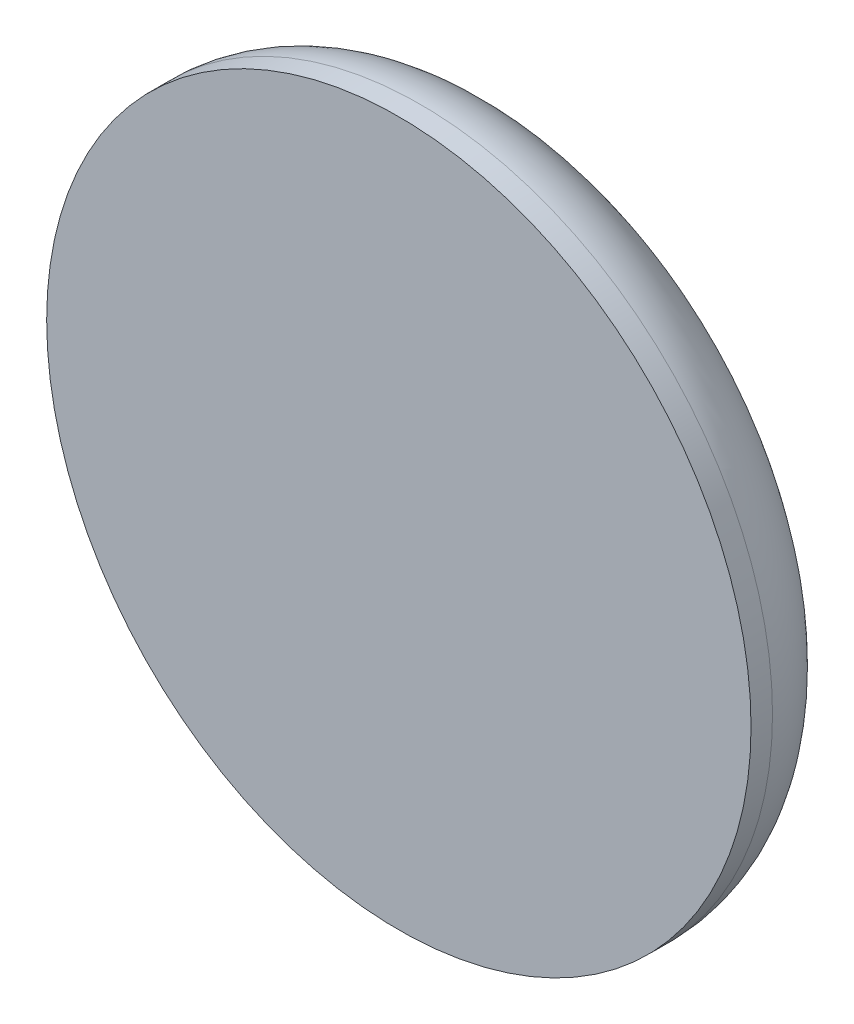
ISO-10303-21;
HEADER;
FILE_DESCRIPTION(('STEP AP214'),'2;1');
FILE_NAME('part.step','',(''),(''),'','','');
FILE_SCHEMA(('AUTOMOTIVE_DESIGN { 1 0 10303 214 1 1 1 1 }'));
ENDSEC;
DATA;
#1=APPLICATION_CONTEXT('core data for automotive mechanical design processes');
#2=APPLICATION_PROTOCOL_DEFINITION('international standard','automotive_design',2000,#1);
#3=PRODUCT_CONTEXT('',#1,'mechanical');
#4=PRODUCT('Part','Part','',(#3));
#5=PRODUCT_RELATED_PRODUCT_CATEGORY('part','',(#4));
#6=PRODUCT_DEFINITION_FORMATION('','',#4);
#7=PRODUCT_DEFINITION_CONTEXT('part definition',#1,'design');
#8=PRODUCT_DEFINITION('design','',#6,#7);
#9=PRODUCT_DEFINITION_SHAPE('','',#8);
#10=(LENGTH_UNIT() NAMED_UNIT(*) SI_UNIT(.MILLI.,.METRE.));
#11=(NAMED_UNIT(*) PLANE_ANGLE_UNIT() SI_UNIT($,.RADIAN.));
#12=(NAMED_UNIT(*) SI_UNIT($,.STERADIAN.) SOLID_ANGLE_UNIT());
#13=UNCERTAINTY_MEASURE_WITH_UNIT(LENGTH_MEASURE(1.E-05),#10,'distance_accuracy_value','');
#14=(GEOMETRIC_REPRESENTATION_CONTEXT(3) GLOBAL_UNCERTAINTY_ASSIGNED_CONTEXT((#13)) GLOBAL_UNIT_ASSIGNED_CONTEXT((#10,
#11,#12)) REPRESENTATION_CONTEXT('',''));
#15=CARTESIAN_POINT('',(0.,0.,0.));
#16=DIRECTION('',(0.,0.,1.));
#17=DIRECTION('',(1.,0.,0.));
#18=AXIS2_PLACEMENT_3D('',#15,#16,#17);
#19=CARTESIAN_POINT('',(0.,0.,1.753125));
#20=DIRECTION('',(0.,0.,1.));
#21=DIRECTION('',(1.,0.,0.));
#22=AXIS2_PLACEMENT_3D('',#19,#20,#21);
#23=SPHERICAL_SURFACE('',#22,2.003125);
#24=CARTESIAN_POINT('',(0.,0.,-0.183077555279449));
#25=DIRECTION('',(0.,0.,1.));
#26=DIRECTION('',(1.,0.,0.));
#27=AXIS2_PLACEMENT_3D('',#24,#25,#26);
#28=CIRCLE('',#27,0.513448566610456);
#29=CARTESIAN_POINT('',(0.513448566610456,0.,-0.183077555279449));
#30=VERTEX_POINT('',#29);
#31=EDGE_CURVE('E10',#30,#30,#28,.T.);
#32=ORIENTED_EDGE('',*,*,#31,.F.);
#33=EDGE_LOOP('',(#32));
#34=FACE_BOUND('',#33,.T.);
#35=ADVANCED_FACE('F37',(#34),#23,.T.);
#36=CARTESIAN_POINT('',(0.,0.,-0.0380889083942487));
#37=DIRECTION('',(0.,0.,1.));
#38=DIRECTION('',(1.,0.,0.));
#39=AXIS2_PLACEMENT_3D('',#36,#37,#38);
#40=TOROIDAL_SURFACE('',#39,0.475,0.15);
#41=ORIENTED_EDGE('',*,*,#31,.T.);
#42=EDGE_LOOP('',(#41));
#43=FACE_BOUND('',#42,.T.);
#44=CARTESIAN_POINT('',(0.,0.,-0.0380889083942491));
#45=DIRECTION('',(0.,0.,1.));
#46=DIRECTION('',(1.,0.,0.));
#47=AXIS2_PLACEMENT_3D('',#44,#45,#46);
#48=CIRCLE('',#47,0.625);
#49=CARTESIAN_POINT('',(0.625,0.,-0.0380889083942491));
#50=VERTEX_POINT('',#49);
#51=EDGE_CURVE('E43',#50,#50,#48,.T.);
#52=ORIENTED_EDGE('',*,*,#51,.F.);
#53=EDGE_LOOP('',(#52));
#54=FACE_BOUND('',#53,.T.);
#55=ADVANCED_FACE('F58',(#43,#54),#40,.T.);
#56=CARTESIAN_POINT('',(0.,0.,0.));
#57=DIRECTION('',(0.,0.,1.));
#58=DIRECTION('',(1.,0.,0.));
#59=AXIS2_PLACEMENT_3D('',#56,#57,#58);
#60=CYLINDRICAL_SURFACE('',#59,0.625000000000001);
#61=ORIENTED_EDGE('',*,*,#51,.T.);
#62=EDGE_LOOP('',(#61));
#63=FACE_BOUND('',#62,.T.);
#64=CARTESIAN_POINT('',(0.,0.,0.));
#65=DIRECTION('',(0.,0.,1.));
#66=DIRECTION('',(1.,0.,0.));
#67=AXIS2_PLACEMENT_3D('',#64,#65,#66);
#68=CIRCLE('',#67,0.625000000000001);
#69=CARTESIAN_POINT('',(0.625000000000001,0.,0.));
#70=VERTEX_POINT('',#69);
#71=EDGE_CURVE('E47',#70,#70,#68,.T.);
#72=ORIENTED_EDGE('',*,*,#71,.F.);
#73=EDGE_LOOP('',(#72));
#74=FACE_BOUND('',#73,.T.);
#75=ADVANCED_FACE('F56',(#63,#74),#60,.T.);
#76=CARTESIAN_POINT('',(0.,0.,0.));
#77=DIRECTION('',(0.,0.,1.));
#78=DIRECTION('',(1.,0.,0.));
#79=AXIS2_PLACEMENT_3D('',#76,#77,#78);
#80=PLANE('',#79);
#81=ORIENTED_EDGE('',*,*,#71,.T.);
#82=EDGE_LOOP('',(#81));
#83=FACE_BOUND('',#82,.T.);
#84=ADVANCED_FACE('F54',(#83),#80,.T.);
#85=CLOSED_SHELL('',(#35,#55,#75,#84));
#86=MANIFOLD_SOLID_BREP('B2',#85);
#87=ADVANCED_BREP_SHAPE_REPRESENTATION('',(#18,#86),#14);
#88=SHAPE_DEFINITION_REPRESENTATION(#9,#87);
ENDSEC;
END-ISO-10303-21;
